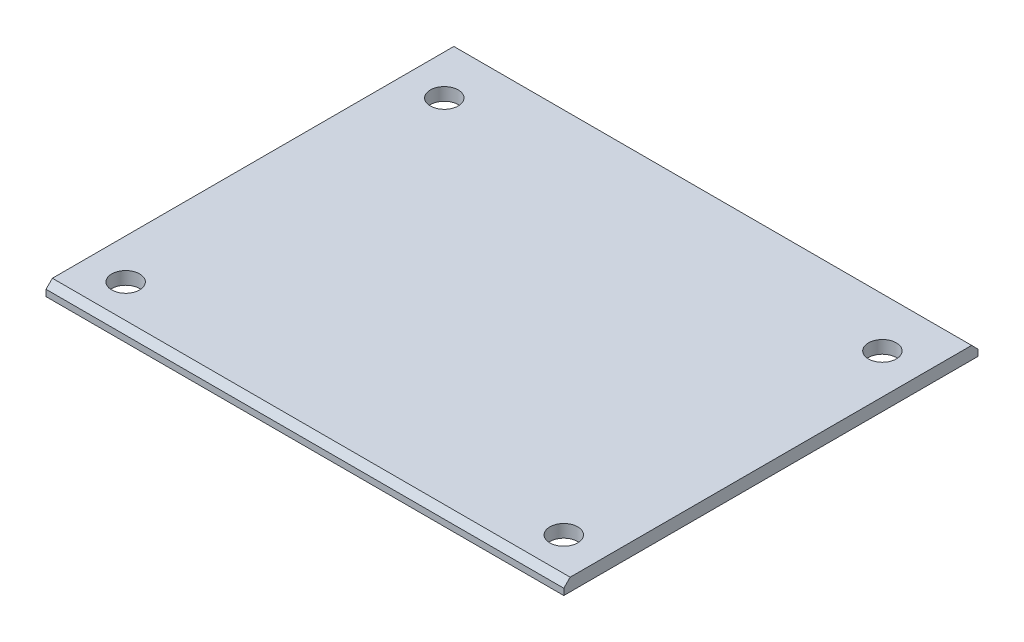
ISO-10303-21;
HEADER;
FILE_DESCRIPTION(('STEP AP214'),'2;1');
FILE_NAME('part.step','',(''),(''),'','','');
FILE_SCHEMA(('AUTOMOTIVE_DESIGN { 1 0 10303 214 1 1 1 1 }'));
ENDSEC;
DATA;
#1=APPLICATION_CONTEXT('core data for automotive mechanical design processes');
#2=APPLICATION_PROTOCOL_DEFINITION('international standard','automotive_design',2000,#1);
#3=PRODUCT_CONTEXT('',#1,'mechanical');
#4=PRODUCT('Part','Part','',(#3));
#5=PRODUCT_RELATED_PRODUCT_CATEGORY('part','',(#4));
#6=PRODUCT_DEFINITION_FORMATION('','',#4);
#7=PRODUCT_DEFINITION_CONTEXT('part definition',#1,'design');
#8=PRODUCT_DEFINITION('design','',#6,#7);
#9=PRODUCT_DEFINITION_SHAPE('','',#8);
#10=(LENGTH_UNIT() NAMED_UNIT(*) SI_UNIT(.MILLI.,.METRE.));
#11=(NAMED_UNIT(*) PLANE_ANGLE_UNIT() SI_UNIT($,.RADIAN.));
#12=(NAMED_UNIT(*) SI_UNIT($,.STERADIAN.) SOLID_ANGLE_UNIT());
#13=UNCERTAINTY_MEASURE_WITH_UNIT(LENGTH_MEASURE(1.E-05),#10,'distance_accuracy_value','');
#14=(GEOMETRIC_REPRESENTATION_CONTEXT(3) GLOBAL_UNCERTAINTY_ASSIGNED_CONTEXT((#13)) GLOBAL_UNIT_ASSIGNED_CONTEXT((#10,
#11,#12)) REPRESENTATION_CONTEXT('',''));
#15=CARTESIAN_POINT('',(0.,0.,0.));
#16=DIRECTION('',(0.,0.,1.));
#17=DIRECTION('',(1.,0.,0.));
#18=AXIS2_PLACEMENT_3D('',#15,#16,#17);
#19=CARTESIAN_POINT('',(32.5,1.6,-26.));
#20=DIRECTION('',(-1.,0.,0.));
#21=DIRECTION('',(0.,0.,1.));
#22=AXIS2_PLACEMENT_3D('',#19,#20,#21);
#23=PLANE('',#22);
#24=DIRECTION('',(0.,-1.,0.));
#25=VECTOR('',#24,1.);
#26=CARTESIAN_POINT('',(32.5,1.6,-26.));
#27=LINE('',#26,#25);
#28=CARTESIAN_POINT('',(32.5,0.799999999999984,-26.));
#29=VERTEX_POINT('',#28);
#30=CARTESIAN_POINT('',(32.5,0.,-26.));
#31=VERTEX_POINT('',#30);
#32=EDGE_CURVE('E85',#29,#31,#27,.T.);
#33=ORIENTED_EDGE('',*,*,#32,.F.);
#34=DIRECTION('',(0.,0.707106781186551,0.707106781186544));
#35=VECTOR('',#34,1.);
#36=CARTESIAN_POINT('',(32.5,1.6,-25.2));
#37=LINE('',#36,#35);
#38=CARTESIAN_POINT('',(32.5,1.6,-25.2));
#39=VERTEX_POINT('',#38);
#40=EDGE_CURVE('E42',#29,#39,#37,.T.);
#41=ORIENTED_EDGE('',*,*,#40,.T.);
#42=DIRECTION('',(0.,0.,-1.));
#43=VECTOR('',#42,1.);
#44=CARTESIAN_POINT('',(32.5,1.6,-26.));
#45=LINE('',#44,#43);
#46=CARTESIAN_POINT('',(32.5,1.6,25.2));
#47=VERTEX_POINT('',#46);
#48=EDGE_CURVE('E117',#47,#39,#45,.T.);
#49=ORIENTED_EDGE('',*,*,#48,.F.);
#50=DIRECTION('',(0.,-0.707106781186547,0.707106781186547));
#51=VECTOR('',#50,1.);
#52=CARTESIAN_POINT('',(32.5,1.6,25.2));
#53=LINE('',#52,#51);
#54=CARTESIAN_POINT('',(32.5,0.799999999999998,26.));
#55=VERTEX_POINT('',#54);
#56=EDGE_CURVE('E49',#47,#55,#53,.T.);
#57=ORIENTED_EDGE('',*,*,#56,.T.);
#58=DIRECTION('',(0.,-1.,0.));
#59=VECTOR('',#58,1.);
#60=CARTESIAN_POINT('',(32.5,1.6,26.));
#61=LINE('',#60,#59);
#62=CARTESIAN_POINT('',(32.5,0.,26.));
#63=VERTEX_POINT('',#62);
#64=EDGE_CURVE('E103',#55,#63,#61,.T.);
#65=ORIENTED_EDGE('',*,*,#64,.T.);
#66=DIRECTION('',(0.,0.,-1.));
#67=VECTOR('',#66,1.);
#68=CARTESIAN_POINT('',(32.5,0.,-26.));
#69=LINE('',#68,#67);
#70=EDGE_CURVE('E99',#63,#31,#69,.T.);
#71=ORIENTED_EDGE('',*,*,#70,.T.);
#72=EDGE_LOOP('',(#33,#41,#49,#57,#65,#71));
#73=FACE_BOUND('',#72,.T.);
#74=ADVANCED_FACE('F34',(#73),#23,.F.);
#75=CARTESIAN_POINT('',(-32.5,1.6,-26.));
#76=DIRECTION('',(0.,0.,1.));
#77=DIRECTION('',(1.,0.,0.));
#78=AXIS2_PLACEMENT_3D('',#75,#76,#77);
#79=PLANE('',#78);
#80=DIRECTION('',(0.,-1.,0.));
#81=VECTOR('',#80,1.);
#82=CARTESIAN_POINT('',(-32.5,1.6,-26.));
#83=LINE('',#82,#81);
#84=CARTESIAN_POINT('',(-32.5,0.799999999999984,-26.));
#85=VERTEX_POINT('',#84);
#86=CARTESIAN_POINT('',(-32.5,0.,-26.));
#87=VERTEX_POINT('',#86);
#88=EDGE_CURVE('E93',#85,#87,#83,.T.);
#89=ORIENTED_EDGE('',*,*,#88,.F.);
#90=DIRECTION('',(1.,0.,0.));
#91=VECTOR('',#90,1.);
#92=CARTESIAN_POINT('',(32.5,0.799999999999984,-26.));
#93=LINE('',#92,#91);
#94=EDGE_CURVE('E57',#85,#29,#93,.T.);
#95=ORIENTED_EDGE('',*,*,#94,.T.);
#96=ORIENTED_EDGE('',*,*,#32,.T.);
#97=DIRECTION('',(-1.,0.,0.));
#98=VECTOR('',#97,1.);
#99=CARTESIAN_POINT('',(-32.5,0.,-26.));
#100=LINE('',#99,#98);
#101=EDGE_CURVE('E88',#31,#87,#100,.T.);
#102=ORIENTED_EDGE('',*,*,#101,.T.);
#103=EDGE_LOOP('',(#89,#95,#96,#102));
#104=FACE_BOUND('',#103,.T.);
#105=ADVANCED_FACE('F87',(#104),#79,.F.);
#106=CARTESIAN_POINT('',(-32.5,1.6,-26.));
#107=DIRECTION('',(1.,0.,0.));
#108=DIRECTION('',(0.,0.,-1.));
#109=AXIS2_PLACEMENT_3D('',#106,#107,#108);
#110=PLANE('',#109);
#111=DIRECTION('',(0.,0.,1.));
#112=VECTOR('',#111,1.);
#113=CARTESIAN_POINT('',(-32.5,1.6,-26.));
#114=LINE('',#113,#112);
#115=CARTESIAN_POINT('',(-32.5,1.6,-25.2));
#116=VERTEX_POINT('',#115);
#117=CARTESIAN_POINT('',(-32.5,1.6,25.2));
#118=VERTEX_POINT('',#117);
#119=EDGE_CURVE('E111',#116,#118,#114,.T.);
#120=ORIENTED_EDGE('',*,*,#119,.F.);
#121=DIRECTION('',(0.,-0.707106781186551,-0.707106781186544));
#122=VECTOR('',#121,1.);
#123=CARTESIAN_POINT('',(-32.5,1.6,-25.2));
#124=LINE('',#123,#122);
#125=EDGE_CURVE('E129',#116,#85,#124,.T.);
#126=ORIENTED_EDGE('',*,*,#125,.T.);
#127=ORIENTED_EDGE('',*,*,#88,.T.);
#128=DIRECTION('',(0.,0.,1.));
#129=VECTOR('',#128,1.);
#130=CARTESIAN_POINT('',(-32.5,0.,-26.));
#131=LINE('',#130,#129);
#132=CARTESIAN_POINT('',(-32.5,0.,26.));
#133=VERTEX_POINT('',#132);
#134=EDGE_CURVE('E101',#87,#133,#131,.T.);
#135=ORIENTED_EDGE('',*,*,#134,.T.);
#136=DIRECTION('',(0.,-1.,0.));
#137=VECTOR('',#136,1.);
#138=CARTESIAN_POINT('',(-32.5,1.6,26.));
#139=LINE('',#138,#137);
#140=CARTESIAN_POINT('',(-32.5,0.799999999999998,26.));
#141=VERTEX_POINT('',#140);
#142=EDGE_CURVE('E119',#141,#133,#139,.T.);
#143=ORIENTED_EDGE('',*,*,#142,.F.);
#144=DIRECTION('',(0.,0.707106781186547,-0.707106781186547));
#145=VECTOR('',#144,1.);
#146=CARTESIAN_POINT('',(-32.5,1.6,25.2));
#147=LINE('',#146,#145);
#148=EDGE_CURVE('E127',#141,#118,#147,.T.);
#149=ORIENTED_EDGE('',*,*,#148,.T.);
#150=EDGE_LOOP('',(#120,#126,#127,#135,#143,#149));
#151=FACE_BOUND('',#150,.T.);
#152=ADVANCED_FACE('F142',(#151),#110,.F.);
#153=CARTESIAN_POINT('',(-32.5,1.6,26.));
#154=DIRECTION('',(0.,0.,-1.));
#155=DIRECTION('',(-1.,0.,0.));
#156=AXIS2_PLACEMENT_3D('',#153,#154,#155);
#157=PLANE('',#156);
#158=ORIENTED_EDGE('',*,*,#64,.F.);
#159=DIRECTION('',(-1.,0.,0.));
#160=VECTOR('',#159,1.);
#161=CARTESIAN_POINT('',(-32.5,0.799999999999998,26.));
#162=LINE('',#161,#160);
#163=EDGE_CURVE('E11',#55,#141,#162,.T.);
#164=ORIENTED_EDGE('',*,*,#163,.T.);
#165=ORIENTED_EDGE('',*,*,#142,.T.);
#166=DIRECTION('',(1.,0.,0.));
#167=VECTOR('',#166,1.);
#168=CARTESIAN_POINT('',(-32.5,0.,26.));
#169=LINE('',#168,#167);
#170=EDGE_CURVE('E115',#133,#63,#169,.T.);
#171=ORIENTED_EDGE('',*,*,#170,.T.);
#172=EDGE_LOOP('',(#158,#164,#165,#171));
#173=FACE_BOUND('',#172,.T.);
#174=ADVANCED_FACE('F148',(#173),#157,.F.);
#175=CARTESIAN_POINT('',(0.,1.6,0.));
#176=DIRECTION('',(0.,1.,0.));
#177=DIRECTION('',(0.,0.,1.));
#178=AXIS2_PLACEMENT_3D('',#175,#176,#177);
#179=PLANE('',#178);
#180=CARTESIAN_POINT('',(27.5,1.6,21.));
#181=DIRECTION('',(0.,1.,0.));
#182=DIRECTION('',(0.,0.,1.));
#183=AXIS2_PLACEMENT_3D('',#180,#181,#182);
#184=CIRCLE('',#183,1.75);
#185=CARTESIAN_POINT('',(27.5,1.6,22.75));
#186=VERTEX_POINT('',#185);
#187=EDGE_CURVE('E211',#186,#186,#184,.T.);
#188=ORIENTED_EDGE('',*,*,#187,.F.);
#189=EDGE_LOOP('',(#188));
#190=FACE_BOUND('',#189,.T.);
#191=CARTESIAN_POINT('',(27.5,1.6,-19.));
#192=DIRECTION('',(0.,1.,0.));
#193=DIRECTION('',(0.,0.,1.));
#194=AXIS2_PLACEMENT_3D('',#191,#192,#193);
#195=CIRCLE('',#194,1.75);
#196=CARTESIAN_POINT('',(27.5,1.6,-17.25));
#197=VERTEX_POINT('',#196);
#198=EDGE_CURVE('E215',#197,#197,#195,.T.);
#199=ORIENTED_EDGE('',*,*,#198,.F.);
#200=EDGE_LOOP('',(#199));
#201=FACE_BOUND('',#200,.T.);
#202=CARTESIAN_POINT('',(-27.5,1.6,-19.));
#203=DIRECTION('',(0.,1.,0.));
#204=DIRECTION('',(0.,0.,1.));
#205=AXIS2_PLACEMENT_3D('',#202,#203,#204);
#206=CIRCLE('',#205,1.75);
#207=CARTESIAN_POINT('',(-27.5,1.6,-17.25));
#208=VERTEX_POINT('',#207);
#209=EDGE_CURVE('E208',#208,#208,#206,.T.);
#210=ORIENTED_EDGE('',*,*,#209,.F.);
#211=EDGE_LOOP('',(#210));
#212=FACE_BOUND('',#211,.T.);
#213=CARTESIAN_POINT('',(-27.5,1.6,21.));
#214=DIRECTION('',(0.,1.,0.));
#215=DIRECTION('',(0.,0.,1.));
#216=AXIS2_PLACEMENT_3D('',#213,#214,#215);
#217=CIRCLE('',#216,1.75);
#218=CARTESIAN_POINT('',(-27.5,1.6,22.75));
#219=VERTEX_POINT('',#218);
#220=EDGE_CURVE('E108',#219,#219,#217,.T.);
#221=ORIENTED_EDGE('',*,*,#220,.F.);
#222=EDGE_LOOP('',(#221));
#223=FACE_BOUND('',#222,.T.);
#224=ORIENTED_EDGE('',*,*,#48,.T.);
#225=DIRECTION('',(-1.,0.,0.));
#226=VECTOR('',#225,1.);
#227=CARTESIAN_POINT('',(-32.5,1.6,-25.2));
#228=LINE('',#227,#226);
#229=EDGE_CURVE('E124',#39,#116,#228,.T.);
#230=ORIENTED_EDGE('',*,*,#229,.T.);
#231=ORIENTED_EDGE('',*,*,#119,.T.);
#232=DIRECTION('',(1.,0.,0.));
#233=VECTOR('',#232,1.);
#234=CARTESIAN_POINT('',(32.5,1.6,25.2));
#235=LINE('',#234,#233);
#236=EDGE_CURVE('E92',#118,#47,#235,.T.);
#237=ORIENTED_EDGE('',*,*,#236,.T.);
#238=EDGE_LOOP('',(#224,#230,#231,#237));
#239=FACE_BOUND('',#238,.T.);
#240=ADVANCED_FACE('F136',(#190,#201,#212,#223,#239),#179,.T.);
#241=CARTESIAN_POINT('',(0.,0.,0.));
#242=DIRECTION('',(0.,1.,0.));
#243=DIRECTION('',(0.,0.,1.));
#244=AXIS2_PLACEMENT_3D('',#241,#242,#243);
#245=PLANE('',#244);
#246=CARTESIAN_POINT('',(27.5,0.,21.));
#247=DIRECTION('',(0.,1.,0.));
#248=DIRECTION('',(0.,0.,1.));
#249=AXIS2_PLACEMENT_3D('',#246,#247,#248);
#250=CIRCLE('',#249,1.75);
#251=CARTESIAN_POINT('',(27.5,0.,22.75));
#252=VERTEX_POINT('',#251);
#253=EDGE_CURVE('E193',#252,#252,#250,.T.);
#254=ORIENTED_EDGE('',*,*,#253,.T.);
#255=EDGE_LOOP('',(#254));
#256=FACE_BOUND('',#255,.T.);
#257=CARTESIAN_POINT('',(27.5,0.,-19.));
#258=DIRECTION('',(0.,1.,0.));
#259=DIRECTION('',(0.,0.,1.));
#260=AXIS2_PLACEMENT_3D('',#257,#258,#259);
#261=CIRCLE('',#260,1.75);
#262=CARTESIAN_POINT('',(27.5,0.,-17.25));
#263=VERTEX_POINT('',#262);
#264=EDGE_CURVE('E197',#263,#263,#261,.T.);
#265=ORIENTED_EDGE('',*,*,#264,.T.);
#266=EDGE_LOOP('',(#265));
#267=FACE_BOUND('',#266,.T.);
#268=CARTESIAN_POINT('',(-27.5,0.,-19.));
#269=DIRECTION('',(0.,1.,0.));
#270=DIRECTION('',(0.,0.,1.));
#271=AXIS2_PLACEMENT_3D('',#268,#269,#270);
#272=CIRCLE('',#271,1.75);
#273=CARTESIAN_POINT('',(-27.5,0.,-17.25));
#274=VERTEX_POINT('',#273);
#275=EDGE_CURVE('E201',#274,#274,#272,.T.);
#276=ORIENTED_EDGE('',*,*,#275,.T.);
#277=EDGE_LOOP('',(#276));
#278=FACE_BOUND('',#277,.T.);
#279=CARTESIAN_POINT('',(-27.5,0.,21.));
#280=DIRECTION('',(0.,1.,0.));
#281=DIRECTION('',(0.,0.,1.));
#282=AXIS2_PLACEMENT_3D('',#279,#280,#281);
#283=CIRCLE('',#282,1.75);
#284=CARTESIAN_POINT('',(-27.5,0.,22.75));
#285=VERTEX_POINT('',#284);
#286=EDGE_CURVE('E105',#285,#285,#283,.T.);
#287=ORIENTED_EDGE('',*,*,#286,.T.);
#288=EDGE_LOOP('',(#287));
#289=FACE_BOUND('',#288,.T.);
#290=ORIENTED_EDGE('',*,*,#70,.F.);
#291=ORIENTED_EDGE('',*,*,#170,.F.);
#292=ORIENTED_EDGE('',*,*,#134,.F.);
#293=ORIENTED_EDGE('',*,*,#101,.F.);
#294=EDGE_LOOP('',(#290,#291,#292,#293));
#295=FACE_BOUND('',#294,.T.);
#296=ADVANCED_FACE('F97',(#256,#267,#278,#289,#295),#245,.F.);
#297=CARTESIAN_POINT('',(-27.5,0.,21.));
#298=DIRECTION('',(0.,1.,0.));
#299=DIRECTION('',(0.,0.,1.));
#300=AXIS2_PLACEMENT_3D('',#297,#298,#299);
#301=CYLINDRICAL_SURFACE('',#300,1.75);
#302=ORIENTED_EDGE('',*,*,#286,.F.);
#303=EDGE_LOOP('',(#302));
#304=FACE_BOUND('',#303,.T.);
#305=ORIENTED_EDGE('',*,*,#220,.T.);
#306=EDGE_LOOP('',(#305));
#307=FACE_BOUND('',#306,.T.);
#308=ADVANCED_FACE('F184',(#304,#307),#301,.F.);
#309=CARTESIAN_POINT('',(-27.5,0.,-19.));
#310=DIRECTION('',(0.,1.,0.));
#311=DIRECTION('',(0.,0.,1.));
#312=AXIS2_PLACEMENT_3D('',#309,#310,#311);
#313=CYLINDRICAL_SURFACE('',#312,1.75);
#314=ORIENTED_EDGE('',*,*,#275,.F.);
#315=EDGE_LOOP('',(#314));
#316=FACE_BOUND('',#315,.T.);
#317=ORIENTED_EDGE('',*,*,#209,.T.);
#318=EDGE_LOOP('',(#317));
#319=FACE_BOUND('',#318,.T.);
#320=ADVANCED_FACE('F177',(#316,#319),#313,.F.);
#321=CARTESIAN_POINT('',(27.5,0.,-19.));
#322=DIRECTION('',(0.,1.,0.));
#323=DIRECTION('',(0.,0.,1.));
#324=AXIS2_PLACEMENT_3D('',#321,#322,#323);
#325=CYLINDRICAL_SURFACE('',#324,1.75);
#326=ORIENTED_EDGE('',*,*,#264,.F.);
#327=EDGE_LOOP('',(#326));
#328=FACE_BOUND('',#327,.T.);
#329=ORIENTED_EDGE('',*,*,#198,.T.);
#330=EDGE_LOOP('',(#329));
#331=FACE_BOUND('',#330,.T.);
#332=ADVANCED_FACE('F171',(#328,#331),#325,.F.);
#333=CARTESIAN_POINT('',(27.5,0.,21.));
#334=DIRECTION('',(0.,1.,0.));
#335=DIRECTION('',(0.,0.,1.));
#336=AXIS2_PLACEMENT_3D('',#333,#334,#335);
#337=CYLINDRICAL_SURFACE('',#336,1.75);
#338=ORIENTED_EDGE('',*,*,#253,.F.);
#339=EDGE_LOOP('',(#338));
#340=FACE_BOUND('',#339,.T.);
#341=ORIENTED_EDGE('',*,*,#187,.T.);
#342=EDGE_LOOP('',(#341));
#343=FACE_BOUND('',#342,.T.);
#344=ADVANCED_FACE('F166',(#340,#343),#337,.F.);
#345=CARTESIAN_POINT('',(0.,1.6,-25.2));
#346=DIRECTION('',(0.,0.707106781186544,-0.707106781186551));
#347=DIRECTION('',(1.,0.,0.));
#348=AXIS2_PLACEMENT_3D('',#345,#346,#347);
#349=PLANE('',#348);
#350=ORIENTED_EDGE('',*,*,#40,.F.);
#351=ORIENTED_EDGE('',*,*,#94,.F.);
#352=ORIENTED_EDGE('',*,*,#125,.F.);
#353=ORIENTED_EDGE('',*,*,#229,.F.);
#354=EDGE_LOOP('',(#350,#351,#352,#353));
#355=FACE_BOUND('',#354,.T.);
#356=ADVANCED_FACE('F140',(#355),#349,.T.);
#357=CARTESIAN_POINT('',(0.,1.6,25.2));
#358=DIRECTION('',(0.,0.707106781186547,0.707106781186547));
#359=DIRECTION('',(-1.,0.,0.));
#360=AXIS2_PLACEMENT_3D('',#357,#358,#359);
#361=PLANE('',#360);
#362=ORIENTED_EDGE('',*,*,#148,.F.);
#363=ORIENTED_EDGE('',*,*,#163,.F.);
#364=ORIENTED_EDGE('',*,*,#56,.F.);
#365=ORIENTED_EDGE('',*,*,#236,.F.);
#366=EDGE_LOOP('',(#362,#363,#364,#365));
#367=FACE_BOUND('',#366,.T.);
#368=ADVANCED_FACE('F36',(#367),#361,.T.);
#369=CLOSED_SHELL('',(#74,#105,#152,#174,#240,#296,#308,#320,#332,#344,#356,#368));
#370=MANIFOLD_SOLID_BREP('B2',#369);
#371=ADVANCED_BREP_SHAPE_REPRESENTATION('',(#18,#370),#14);
#372=SHAPE_DEFINITION_REPRESENTATION(#9,#371);
ENDSEC;
END-ISO-10303-21;
